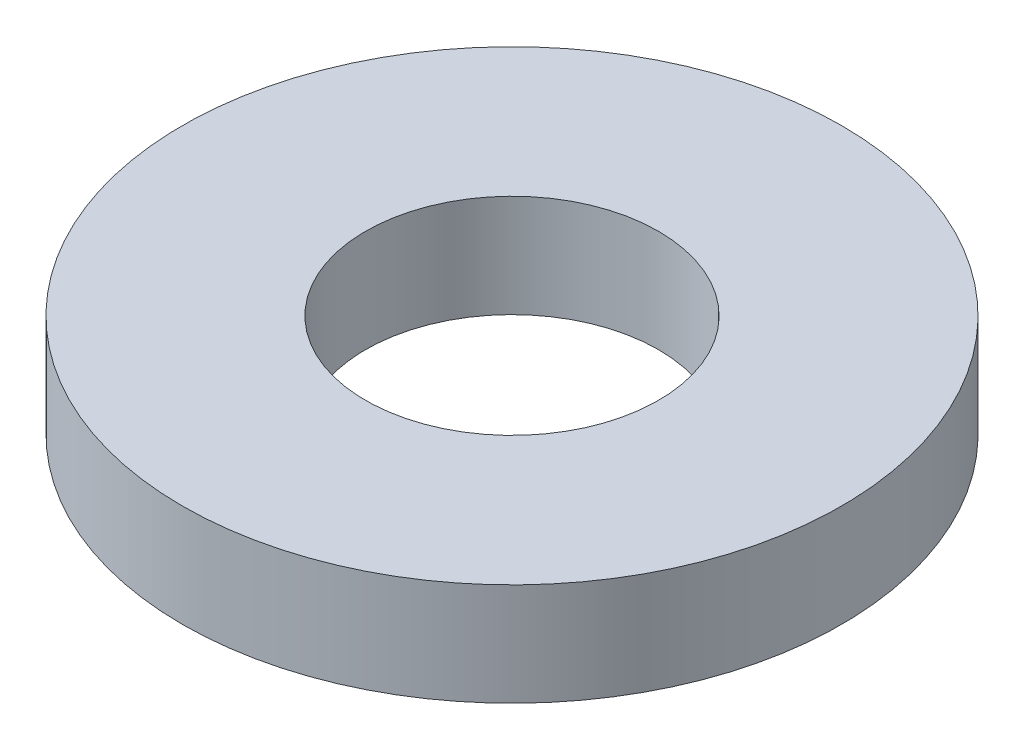
ISO-10303-21;
HEADER;
FILE_DESCRIPTION(('STEP AP214'),'2;1');
FILE_NAME('part.step','',(''),(''),'','','');
FILE_SCHEMA(('AUTOMOTIVE_DESIGN { 1 0 10303 214 1 1 1 1 }'));
ENDSEC;
DATA;
#1=APPLICATION_CONTEXT('core data for automotive mechanical design processes');
#2=APPLICATION_PROTOCOL_DEFINITION('international standard','automotive_design',2000,#1);
#3=PRODUCT_CONTEXT('',#1,'mechanical');
#4=PRODUCT('Part','Part','',(#3));
#5=PRODUCT_RELATED_PRODUCT_CATEGORY('part','',(#4));
#6=PRODUCT_DEFINITION_FORMATION('','',#4);
#7=PRODUCT_DEFINITION_CONTEXT('part definition',#1,'design');
#8=PRODUCT_DEFINITION('design','',#6,#7);
#9=PRODUCT_DEFINITION_SHAPE('','',#8);
#10=(LENGTH_UNIT() NAMED_UNIT(*) SI_UNIT(.MILLI.,.METRE.));
#11=(NAMED_UNIT(*) PLANE_ANGLE_UNIT() SI_UNIT($,.RADIAN.));
#12=(NAMED_UNIT(*) SI_UNIT($,.STERADIAN.) SOLID_ANGLE_UNIT());
#13=UNCERTAINTY_MEASURE_WITH_UNIT(LENGTH_MEASURE(1.E-05),#10,'distance_accuracy_value','');
#14=(GEOMETRIC_REPRESENTATION_CONTEXT(3) GLOBAL_UNCERTAINTY_ASSIGNED_CONTEXT((#13)) GLOBAL_UNIT_ASSIGNED_CONTEXT((#10,
#11,#12)) REPRESENTATION_CONTEXT('',''));
#15=CARTESIAN_POINT('',(0.,0.,0.));
#16=DIRECTION('',(0.,0.,1.));
#17=DIRECTION('',(1.,0.,0.));
#18=AXIS2_PLACEMENT_3D('',#15,#16,#17);
#19=CARTESIAN_POINT('',(0.,21.,0.));
#20=DIRECTION('',(0.,-1.,0.));
#21=DIRECTION('',(0.,0.,-1.));
#22=AXIS2_PLACEMENT_3D('',#19,#20,#21);
#23=CYLINDRICAL_SURFACE('',#22,67.5);
#24=CARTESIAN_POINT('',(0.,21.,0.));
#25=DIRECTION('',(0.,1.,0.));
#26=DIRECTION('',(0.,0.,1.));
#27=AXIS2_PLACEMENT_3D('',#24,#25,#26);
#28=CIRCLE('',#27,67.5);
#29=CARTESIAN_POINT('',(0.,21.,-67.5));
#30=VERTEX_POINT('',#29);
#31=EDGE_CURVE('E10',#30,#30,#28,.T.);
#32=CARTESIAN_POINT('',(0.,0.,0.));
#33=DIRECTION('',(0.,1.,0.));
#34=DIRECTION('',(0.,0.,1.));
#35=AXIS2_PLACEMENT_3D('',#32,#33,#34);
#36=CIRCLE('',#35,67.5);
#37=CARTESIAN_POINT('',(0.,0.,-67.5));
#38=VERTEX_POINT('',#37);
#39=EDGE_CURVE('E37',#38,#38,#36,.T.);
#40=CARTESIAN_POINT('',(0.,21.,-67.5));
#41=CARTESIAN_POINT('',(0.,20.78125,-67.5));
#42=CARTESIAN_POINT('',(0.,20.5625,-67.5));
#43=CARTESIAN_POINT('',(0.,20.125,-67.5));
#44=CARTESIAN_POINT('',(0.,19.90625,-67.5));
#45=CARTESIAN_POINT('',(0.,19.46875,-67.5));
#46=CARTESIAN_POINT('',(0.,19.25,-67.5));
#47=CARTESIAN_POINT('',(0.,18.8125,-67.5));
#48=CARTESIAN_POINT('',(0.,18.59375,-67.5));
#49=CARTESIAN_POINT('',(0.,18.15625,-67.5));
#50=CARTESIAN_POINT('',(0.,17.9375,-67.5));
#51=CARTESIAN_POINT('',(0.,17.5,-67.5));
#52=CARTESIAN_POINT('',(0.,17.28125,-67.5));
#53=CARTESIAN_POINT('',(0.,16.84375,-67.5));
#54=CARTESIAN_POINT('',(0.,16.625,-67.5));
#55=CARTESIAN_POINT('',(0.,16.1875,-67.5));
#56=CARTESIAN_POINT('',(0.,15.96875,-67.5));
#57=CARTESIAN_POINT('',(0.,15.53125,-67.5));
#58=CARTESIAN_POINT('',(0.,15.3125,-67.5));
#59=CARTESIAN_POINT('',(0.,14.875,-67.5));
#60=CARTESIAN_POINT('',(0.,14.65625,-67.5));
#61=CARTESIAN_POINT('',(0.,14.21875,-67.5));
#62=CARTESIAN_POINT('',(0.,14.,-67.5));
#63=CARTESIAN_POINT('',(0.,13.5625,-67.5));
#64=CARTESIAN_POINT('',(0.,13.34375,-67.5));
#65=CARTESIAN_POINT('',(0.,12.90625,-67.5));
#66=CARTESIAN_POINT('',(0.,12.6875,-67.5));
#67=CARTESIAN_POINT('',(0.,12.25,-67.5));
#68=CARTESIAN_POINT('',(0.,12.03125,-67.5));
#69=CARTESIAN_POINT('',(0.,11.59375,-67.5));
#70=CARTESIAN_POINT('',(0.,11.375,-67.5));
#71=CARTESIAN_POINT('',(0.,10.9375,-67.5));
#72=CARTESIAN_POINT('',(0.,10.71875,-67.5));
#73=CARTESIAN_POINT('',(0.,10.28125,-67.5));
#74=CARTESIAN_POINT('',(0.,10.0625,-67.5));
#75=CARTESIAN_POINT('',(0.,9.625,-67.5));
#76=CARTESIAN_POINT('',(0.,9.40625,-67.5));
#77=CARTESIAN_POINT('',(0.,8.96875,-67.5));
#78=CARTESIAN_POINT('',(0.,8.75,-67.5));
#79=CARTESIAN_POINT('',(0.,8.3125,-67.5));
#80=CARTESIAN_POINT('',(0.,8.09375,-67.5));
#81=CARTESIAN_POINT('',(0.,7.65625,-67.5));
#82=CARTESIAN_POINT('',(0.,7.4375,-67.5));
#83=CARTESIAN_POINT('',(0.,7.,-67.5));
#84=CARTESIAN_POINT('',(0.,6.78125,-67.5));
#85=CARTESIAN_POINT('',(0.,6.34375,-67.5));
#86=CARTESIAN_POINT('',(0.,6.125,-67.5));
#87=CARTESIAN_POINT('',(0.,5.6875,-67.5));
#88=CARTESIAN_POINT('',(0.,5.46875,-67.5));
#89=CARTESIAN_POINT('',(0.,5.03125,-67.5));
#90=CARTESIAN_POINT('',(0.,4.8125,-67.5));
#91=CARTESIAN_POINT('',(0.,4.375,-67.5));
#92=CARTESIAN_POINT('',(0.,4.15625,-67.5));
#93=CARTESIAN_POINT('',(0.,3.71875,-67.5));
#94=CARTESIAN_POINT('',(0.,3.5,-67.5));
#95=CARTESIAN_POINT('',(0.,3.0625,-67.5));
#96=CARTESIAN_POINT('',(0.,2.84375,-67.5));
#97=CARTESIAN_POINT('',(0.,2.40625,-67.5));
#98=CARTESIAN_POINT('',(0.,2.1875,-67.5));
#99=CARTESIAN_POINT('',(0.,1.75,-67.5));
#100=CARTESIAN_POINT('',(0.,1.53125,-67.5));
#101=CARTESIAN_POINT('',(0.,1.09375,-67.5));
#102=CARTESIAN_POINT('',(0.,0.875000000000001,-67.5));
#103=CARTESIAN_POINT('',(0.,0.4375,-67.5));
#104=CARTESIAN_POINT('',(0.,0.21875,-67.5));
#105=CARTESIAN_POINT('',(0.,0.,-67.5));
#106=B_SPLINE_CURVE_WITH_KNOTS('',3,(#40,#41,#42,#43,#44,#45,#46,#47,#48,#49,#50,#51,#52,#53,
#54,#55,#56,#57,#58,#59,#60,#61,#62,#63,#64,#65,#66,#67,#68,#69,#70,#71,#72,#73,#74,#75,#76,#77,
#78,#79,#80,#81,#82,#83,#84,#85,#86,#87,#88,#89,#90,#91,#92,#93,#94,#95,#96,#97,#98,#99,#100,
#101,#102,#103,#104,#105),.UNSPECIFIED.,.F.,.F.,(4,2,2,2,2,2,2,2,2,2,2,2,2,2,2,2,2,2,2,2,2,2,2,
2,2,2,2,2,2,2,2,2,4),(0.,0.656250000000001,1.3125,1.96875,2.625,3.28125,3.9375,4.59375,5.25,
5.90625,6.5625,7.21875,7.875,8.53125,9.1875,9.84375,10.5,11.15625,11.8125,12.46875,13.125,
13.78125,14.4375,15.09375,15.75,16.40625,17.0625,17.71875,18.375,19.03125,19.6875,20.34375,21.),.UNSPECIFIED.);
#107=EDGE_CURVE('BSEAM40',#30,#38,#106,.T.);
#108=ORIENTED_EDGE('',*,*,#31,.F.);
#109=ORIENTED_EDGE('',*,*,#39,.T.);
#110=ORIENTED_EDGE('',*,*,#107,.T.);
#111=ORIENTED_EDGE('',*,*,#107,.F.);
#112=EDGE_LOOP('',(#108,#110,#109,#111));
#113=FACE_BOUND('',#112,.T.);
#114=ADVANCED_FACE('F40',(#113),#23,.T.);
#115=CARTESIAN_POINT('',(0.,21.,0.));
#116=DIRECTION('',(0.,1.,0.));
#117=DIRECTION('',(0.,0.,1.));
#118=AXIS2_PLACEMENT_3D('',#115,#116,#117);
#119=PLANE('',#118);
#120=CARTESIAN_POINT('',(0.,21.,0.));
#121=DIRECTION('',(0.,1.,0.));
#122=DIRECTION('',(0.,0.,1.));
#123=AXIS2_PLACEMENT_3D('',#120,#121,#122);
#124=CIRCLE('',#123,30.);
#125=CARTESIAN_POINT('',(0.,21.,-30.));
#126=VERTEX_POINT('',#125);
#127=EDGE_CURVE('E50',#126,#126,#124,.T.);
#128=ORIENTED_EDGE('',*,*,#127,.F.);
#129=EDGE_LOOP('',(#128));
#130=FACE_BOUND('',#129,.T.);
#131=ORIENTED_EDGE('',*,*,#31,.T.);
#132=EDGE_LOOP('',(#131));
#133=FACE_BOUND('',#132,.T.);
#134=ADVANCED_FACE('F59',(#130,#133),#119,.T.);
#135=CARTESIAN_POINT('',(0.,0.,0.));
#136=DIRECTION('',(0.,1.,0.));
#137=DIRECTION('',(0.,0.,1.));
#138=AXIS2_PLACEMENT_3D('',#135,#136,#137);
#139=PLANE('',#138);
#140=CARTESIAN_POINT('',(0.,0.,0.));
#141=DIRECTION('',(0.,1.,0.));
#142=DIRECTION('',(0.,0.,1.));
#143=AXIS2_PLACEMENT_3D('',#140,#141,#142);
#144=CIRCLE('',#143,30.);
#145=CARTESIAN_POINT('',(0.,0.,-30.));
#146=VERTEX_POINT('',#145);
#147=EDGE_CURVE('E47',#146,#146,#144,.T.);
#148=ORIENTED_EDGE('',*,*,#147,.T.);
#149=EDGE_LOOP('',(#148));
#150=FACE_BOUND('',#149,.T.);
#151=ORIENTED_EDGE('',*,*,#39,.F.);
#152=EDGE_LOOP('',(#151));
#153=FACE_BOUND('',#152,.T.);
#154=ADVANCED_FACE('F58',(#150,#153),#139,.F.);
#155=CARTESIAN_POINT('',(0.,21.,0.));
#156=DIRECTION('',(0.,-1.,0.));
#157=DIRECTION('',(0.,0.,-1.));
#158=AXIS2_PLACEMENT_3D('',#155,#156,#157);
#159=CYLINDRICAL_SURFACE('',#158,30.);
#160=CARTESIAN_POINT('',(0.,21.,-30.));
#161=CARTESIAN_POINT('',(0.,20.78125,-30.));
#162=CARTESIAN_POINT('',(0.,20.5625,-30.));
#163=CARTESIAN_POINT('',(0.,20.125,-30.));
#164=CARTESIAN_POINT('',(0.,19.90625,-30.));
#165=CARTESIAN_POINT('',(0.,19.46875,-30.));
#166=CARTESIAN_POINT('',(0.,19.25,-30.));
#167=CARTESIAN_POINT('',(0.,18.8125,-30.));
#168=CARTESIAN_POINT('',(0.,18.59375,-30.));
#169=CARTESIAN_POINT('',(0.,18.15625,-30.));
#170=CARTESIAN_POINT('',(0.,17.9375,-30.));
#171=CARTESIAN_POINT('',(0.,17.5,-30.));
#172=CARTESIAN_POINT('',(0.,17.28125,-30.));
#173=CARTESIAN_POINT('',(0.,16.84375,-30.));
#174=CARTESIAN_POINT('',(0.,16.625,-30.));
#175=CARTESIAN_POINT('',(0.,16.1875,-30.));
#176=CARTESIAN_POINT('',(0.,15.96875,-30.));
#177=CARTESIAN_POINT('',(0.,15.53125,-30.));
#178=CARTESIAN_POINT('',(0.,15.3125,-30.));
#179=CARTESIAN_POINT('',(0.,14.875,-30.));
#180=CARTESIAN_POINT('',(0.,14.65625,-30.));
#181=CARTESIAN_POINT('',(0.,14.21875,-30.));
#182=CARTESIAN_POINT('',(0.,14.,-30.));
#183=CARTESIAN_POINT('',(0.,13.5625,-30.));
#184=CARTESIAN_POINT('',(0.,13.34375,-30.));
#185=CARTESIAN_POINT('',(0.,12.90625,-30.));
#186=CARTESIAN_POINT('',(0.,12.6875,-30.));
#187=CARTESIAN_POINT('',(0.,12.25,-30.));
#188=CARTESIAN_POINT('',(0.,12.03125,-30.));
#189=CARTESIAN_POINT('',(0.,11.59375,-30.));
#190=CARTESIAN_POINT('',(0.,11.375,-30.));
#191=CARTESIAN_POINT('',(0.,10.9375,-30.));
#192=CARTESIAN_POINT('',(0.,10.71875,-30.));
#193=CARTESIAN_POINT('',(0.,10.28125,-30.));
#194=CARTESIAN_POINT('',(0.,10.0625,-30.));
#195=CARTESIAN_POINT('',(0.,9.625,-30.));
#196=CARTESIAN_POINT('',(0.,9.40625,-30.));
#197=CARTESIAN_POINT('',(0.,8.96875,-30.));
#198=CARTESIAN_POINT('',(0.,8.75,-30.));
#199=CARTESIAN_POINT('',(0.,8.3125,-30.));
#200=CARTESIAN_POINT('',(0.,8.09375,-30.));
#201=CARTESIAN_POINT('',(0.,7.65625,-30.));
#202=CARTESIAN_POINT('',(0.,7.4375,-30.));
#203=CARTESIAN_POINT('',(0.,7.,-30.));
#204=CARTESIAN_POINT('',(0.,6.78125,-30.));
#205=CARTESIAN_POINT('',(0.,6.34375,-30.));
#206=CARTESIAN_POINT('',(0.,6.125,-30.));
#207=CARTESIAN_POINT('',(0.,5.6875,-30.));
#208=CARTESIAN_POINT('',(0.,5.46875,-30.));
#209=CARTESIAN_POINT('',(0.,5.03125,-30.));
#210=CARTESIAN_POINT('',(0.,4.8125,-30.));
#211=CARTESIAN_POINT('',(0.,4.375,-30.));
#212=CARTESIAN_POINT('',(0.,4.15625,-30.));
#213=CARTESIAN_POINT('',(0.,3.71875,-30.));
#214=CARTESIAN_POINT('',(0.,3.5,-30.));
#215=CARTESIAN_POINT('',(0.,3.0625,-30.));
#216=CARTESIAN_POINT('',(0.,2.84375,-30.));
#217=CARTESIAN_POINT('',(0.,2.40625,-30.));
#218=CARTESIAN_POINT('',(0.,2.1875,-30.));
#219=CARTESIAN_POINT('',(0.,1.75,-30.));
#220=CARTESIAN_POINT('',(0.,1.53125,-30.));
#221=CARTESIAN_POINT('',(0.,1.09375,-30.));
#222=CARTESIAN_POINT('',(0.,0.875000000000001,-30.));
#223=CARTESIAN_POINT('',(0.,0.4375,-30.));
#224=CARTESIAN_POINT('',(0.,0.21875,-30.));
#225=CARTESIAN_POINT('',(0.,0.,-30.));
#226=B_SPLINE_CURVE_WITH_KNOTS('',3,(#160,#161,#162,#163,#164,#165,#166,#167,#168,#169,#170,
#171,#172,#173,#174,#175,#176,#177,#178,#179,#180,#181,#182,#183,#184,#185,#186,#187,#188,#189,
#190,#191,#192,#193,#194,#195,#196,#197,#198,#199,#200,#201,#202,#203,#204,#205,#206,#207,#208,
#209,#210,#211,#212,#213,#214,#215,#216,#217,#218,#219,#220,#221,#222,#223,#224,#225),
.UNSPECIFIED.,.F.,.F.,(4,2,2,2,2,2,2,2,2,2,2,2,2,2,2,2,2,2,2,2,2,2,2,2,2,2,2,2,2,2,2,2,4),(0.,
0.656249999999997,1.3125,1.96875,2.625,3.28125,3.9375,4.59375,5.25,5.90625,6.5625,7.21875,7.875,
8.53125,9.1875,9.84375,10.5,11.15625,11.8125,12.46875,13.125,13.78125,14.4375,15.09375,15.75,
16.40625,17.0625,17.71875,18.375,19.03125,19.6875,20.34375,21.),.UNSPECIFIED.);
#227=EDGE_CURVE('BSEAM54',#126,#146,#226,.T.);
#228=ORIENTED_EDGE('',*,*,#127,.T.);
#229=ORIENTED_EDGE('',*,*,#147,.F.);
#230=ORIENTED_EDGE('',*,*,#227,.T.);
#231=ORIENTED_EDGE('',*,*,#227,.F.);
#232=EDGE_LOOP('',(#228,#230,#229,#231));
#233=FACE_BOUND('',#232,.T.);
#234=ADVANCED_FACE('F54',(#233),#159,.F.);
#235=CLOSED_SHELL('',(#114,#134,#154,#234));
#236=MANIFOLD_SOLID_BREP('B2',#235);
#237=ADVANCED_BREP_SHAPE_REPRESENTATION('',(#18,#236),#14);
#238=SHAPE_DEFINITION_REPRESENTATION(#9,#237);
ENDSEC;
END-ISO-10303-21;
